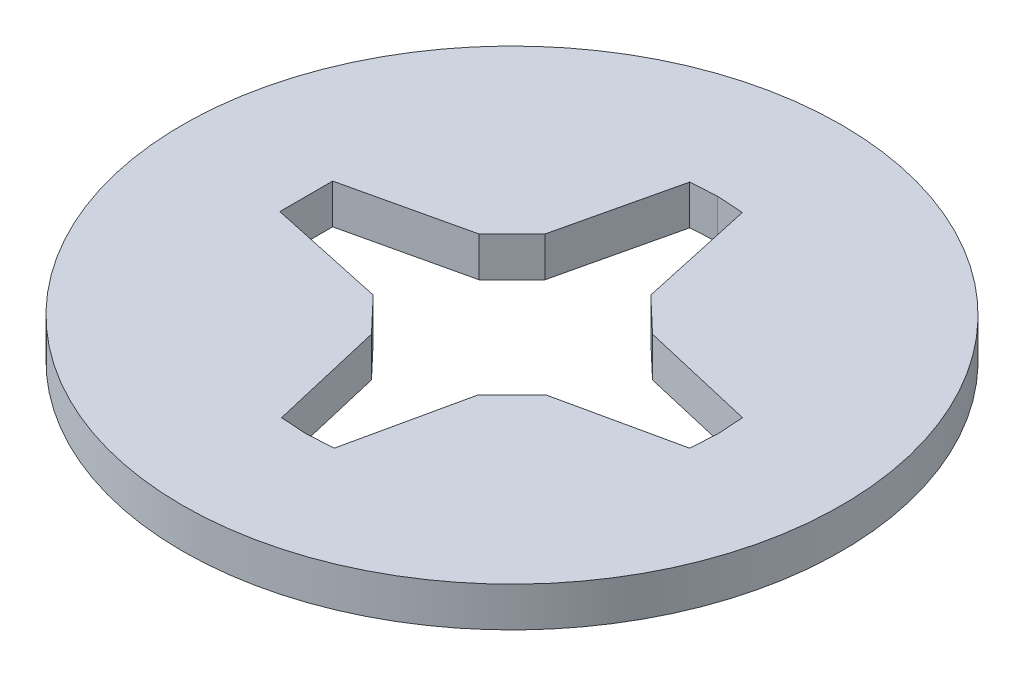
ISO-10303-21;
HEADER;
FILE_DESCRIPTION(('STEP AP214'),'2;1');
FILE_NAME('part.step','',(''),(''),'','','');
FILE_SCHEMA(('AUTOMOTIVE_DESIGN { 1 0 10303 214 1 1 1 1 }'));
ENDSEC;
DATA;
#1=APPLICATION_CONTEXT('core data for automotive mechanical design processes');
#2=APPLICATION_PROTOCOL_DEFINITION('international standard','automotive_design',2000,#1);
#3=PRODUCT_CONTEXT('',#1,'mechanical');
#4=PRODUCT('Part','Part','',(#3));
#5=PRODUCT_RELATED_PRODUCT_CATEGORY('part','',(#4));
#6=PRODUCT_DEFINITION_FORMATION('','',#4);
#7=PRODUCT_DEFINITION_CONTEXT('part definition',#1,'design');
#8=PRODUCT_DEFINITION('design','',#6,#7);
#9=PRODUCT_DEFINITION_SHAPE('','',#8);
#10=(LENGTH_UNIT() NAMED_UNIT(*) SI_UNIT(.MILLI.,.METRE.));
#11=(NAMED_UNIT(*) PLANE_ANGLE_UNIT() SI_UNIT($,.RADIAN.));
#12=(NAMED_UNIT(*) SI_UNIT($,.STERADIAN.) SOLID_ANGLE_UNIT());
#13=UNCERTAINTY_MEASURE_WITH_UNIT(LENGTH_MEASURE(1.E-05),#10,'distance_accuracy_value','');
#14=(GEOMETRIC_REPRESENTATION_CONTEXT(3) GLOBAL_UNCERTAINTY_ASSIGNED_CONTEXT((#13)) GLOBAL_UNIT_ASSIGNED_CONTEXT((#10,
#11,#12)) REPRESENTATION_CONTEXT('',''));
#15=CARTESIAN_POINT('',(0.,0.,0.));
#16=DIRECTION('',(0.,0.,1.));
#17=DIRECTION('',(1.,0.,0.));
#18=AXIS2_PLACEMENT_3D('',#15,#16,#17);
#19=CARTESIAN_POINT('',(0.0664001122128999,3.,0.0664001122129068));
#20=DIRECTION('',(0.,1.,0.));
#21=DIRECTION('',(0.,0.,1.));
#22=AXIS2_PLACEMENT_3D('',#19,#20,#21);
#23=PLANE('',#22);
#24=CARTESIAN_POINT('',(0.0664001122128999,3.,0.0664001122129068));
#25=DIRECTION('',(0.,1.,0.));
#26=DIRECTION('',(0.,0.,1.));
#27=AXIS2_PLACEMENT_3D('',#24,#25,#26);
#28=CIRCLE('',#27,24.9335998877871);
#29=CARTESIAN_POINT('',(0.0664001122128999,3.,25.));
#30=VERTEX_POINT('',#29);
#31=EDGE_CURVE('E11',#30,#30,#28,.T.);
#32=ORIENTED_EDGE('',*,*,#31,.T.);
#33=EDGE_LOOP('',(#32));
#34=FACE_BOUND('',#33,.T.);
#35=DIRECTION('',(0.688581474690036,0.,0.725158984439754));
#36=VECTOR('',#35,1.);
#37=CARTESIAN_POINT('',(-4.,3.,6.63280022442582));
#38=LINE('',#37,#36);
#39=CARTESIAN_POINT('',(-6.5,3.,4.));
#40=VERTEX_POINT('',#39);
#41=CARTESIAN_POINT('',(-4.,3.,6.63280022442582));
#42=VERTEX_POINT('',#41);
#43=EDGE_CURVE('E188',#40,#42,#38,.T.);
#44=ORIENTED_EDGE('',*,*,#43,.F.);
#45=DIRECTION('',(0.977690359369516,0.,0.210051329907491));
#46=VECTOR('',#45,1.);
#47=CARTESIAN_POINT('',(-15.5,3.,2.06640011221291));
#48=LINE('',#47,#46);
#49=CARTESIAN_POINT('',(-15.5,3.,2.06640011221291));
#50=VERTEX_POINT('',#49);
#51=EDGE_CURVE('E174',#50,#40,#48,.T.);
#52=ORIENTED_EDGE('',*,*,#51,.F.);
#53=DIRECTION('',(0.,0.,1.));
#54=VECTOR('',#53,1.);
#55=CARTESIAN_POINT('',(-15.5,3.,0.0664001122129068));
#56=LINE('',#55,#54);
#57=CARTESIAN_POINT('',(-15.5,3.,-1.93359988778709));
#58=VERTEX_POINT('',#57);
#59=EDGE_CURVE('E168',#58,#50,#56,.T.);
#60=ORIENTED_EDGE('',*,*,#59,.F.);
#61=DIRECTION('',(-0.974640275469277,0.,0.223777419399659));
#62=VECTOR('',#61,1.);
#63=CARTESIAN_POINT('',(-15.5,3.,-1.93359988778709));
#64=LINE('',#63,#62);
#65=CARTESIAN_POINT('',(-6.5,3.,-4.));
#66=VERTEX_POINT('',#65);
#67=EDGE_CURVE('E239',#66,#58,#64,.T.);
#68=ORIENTED_EDGE('',*,*,#67,.F.);
#69=DIRECTION('',(-0.707106781186548,0.,0.707106781186547));
#70=VECTOR('',#69,1.);
#71=CARTESIAN_POINT('',(-6.5,3.,-4.));
#72=LINE('',#71,#70);
#73=CARTESIAN_POINT('',(-4.,3.,-6.5));
#74=VERTEX_POINT('',#73);
#75=EDGE_CURVE('E236',#74,#66,#72,.T.);
#76=ORIENTED_EDGE('',*,*,#75,.F.);
#77=DIRECTION('',(-0.227282746645249,0.,0.973828810971103));
#78=VECTOR('',#77,1.);
#79=CARTESIAN_POINT('',(-1.92946872423652,3.,-15.3715181425646));
#80=LINE('',#79,#78);
#81=CARTESIAN_POINT('',(-1.92946872423652,3.,-15.3715181425646));
#82=VERTEX_POINT('',#81);
#83=EDGE_CURVE('E233',#82,#74,#80,.T.);
#84=ORIENTED_EDGE('',*,*,#83,.F.);
#85=DIRECTION('',(-0.997934418224708,0.,0.0642409287177079));
#86=VECTOR('',#85,1.);
#87=CARTESIAN_POINT('',(0.0664001122128999,3.,-15.5));
#88=LINE('',#87,#86);
#89=CARTESIAN_POINT('',(0.0664001122128999,3.,-15.5));
#90=VERTEX_POINT('',#89);
#91=EDGE_CURVE('E230',#90,#82,#88,.T.);
#92=ORIENTED_EDGE('',*,*,#91,.F.);
#93=DIRECTION('',(-0.99794234969612,0.,-0.064117600415077));
#94=VECTOR('',#93,1.);
#95=CARTESIAN_POINT('',(0.0664001122128999,3.,-15.5));
#96=LINE('',#95,#94);
#97=CARTESIAN_POINT('',(2.05845315665964,3.,-15.3720109822493));
#98=VERTEX_POINT('',#97);
#99=EDGE_CURVE('E227',#98,#90,#96,.T.);
#100=ORIENTED_EDGE('',*,*,#99,.F.);
#101=DIRECTION('',(-0.213780357901352,0.,-0.976881752606512));
#102=VECTOR('',#101,1.);
#103=CARTESIAN_POINT('',(2.05845315665964,3.,-15.3720109822493));
#104=LINE('',#103,#102);
#105=CARTESIAN_POINT('',(4.,3.,-6.5));
#106=VERTEX_POINT('',#105);
#107=EDGE_CURVE('E224',#106,#98,#104,.T.);
#108=ORIENTED_EDGE('',*,*,#107,.F.);
#109=DIRECTION('',(-0.725158984439753,0.,-0.688581474690037));
#110=VECTOR('',#109,1.);
#111=CARTESIAN_POINT('',(4.,3.,-6.5));
#112=LINE('',#111,#110);
#113=CARTESIAN_POINT('',(6.63280022442581,3.,-4.));
#114=VERTEX_POINT('',#113);
#115=EDGE_CURVE('E221',#114,#106,#112,.T.);
#116=ORIENTED_EDGE('',*,*,#115,.F.);
#117=DIRECTION('',(-0.973926076011745,0.,-0.226865595594318));
#118=VECTOR('',#117,1.);
#119=CARTESIAN_POINT('',(6.63280022442581,3.,-4.));
#120=LINE('',#119,#118);
#121=CARTESIAN_POINT('',(15.5037837135069,3.,-1.93359988778709));
#122=VERTEX_POINT('',#121);
#123=EDGE_CURVE('E218',#122,#114,#120,.T.);
#124=ORIENTED_EDGE('',*,*,#123,.F.);
#125=DIRECTION('',(-0.0643744533232966,0.,-0.997925813755375));
#126=VECTOR('',#125,1.);
#127=CARTESIAN_POINT('',(15.6328002244258,3.,0.0664001122129068));
#128=LINE('',#127,#126);
#129=CARTESIAN_POINT('',(15.6328002244258,3.,0.0664001122129068));
#130=VERTEX_POINT('',#129);
#131=EDGE_CURVE('E215',#130,#122,#128,.T.);
#132=ORIENTED_EDGE('',*,*,#131,.F.);
#133=DIRECTION('',(0.0643744533232966,0.,-0.997925813755375));
#134=VECTOR('',#133,1.);
#135=CARTESIAN_POINT('',(15.6328002244258,3.,0.0664001122129068));
#136=LINE('',#135,#134);
#137=CARTESIAN_POINT('',(15.5037837135069,3.,2.06640011221291));
#138=VERTEX_POINT('',#137);
#139=EDGE_CURVE('E212',#138,#130,#136,.T.);
#140=ORIENTED_EDGE('',*,*,#139,.F.);
#141=DIRECTION('',(0.977059036387169,0.,-0.21296863481315));
#142=VECTOR('',#141,1.);
#143=CARTESIAN_POINT('',(6.63280022442581,3.,4.));
#144=LINE('',#143,#142);
#145=CARTESIAN_POINT('',(6.63280022442581,3.,4.));
#146=VERTEX_POINT('',#145);
#147=EDGE_CURVE('E209',#146,#138,#144,.T.);
#148=ORIENTED_EDGE('',*,*,#147,.F.);
#149=DIRECTION('',(0.707106781186547,0.,-0.707106781186548));
#150=VECTOR('',#149,1.);
#151=CARTESIAN_POINT('',(6.63280022442581,3.,4.));
#152=LINE('',#151,#150);
#153=CARTESIAN_POINT('',(4.,3.,6.63280022442581));
#154=VERTEX_POINT('',#153);
#155=EDGE_CURVE('E206',#154,#146,#152,.T.);
#156=ORIENTED_EDGE('',*,*,#155,.F.);
#157=DIRECTION('',(0.213390669499355,0.,-0.976966950398332));
#158=VECTOR('',#157,1.);
#159=CARTESIAN_POINT('',(4.,3.,6.63280022442581));
#160=LINE('',#159,#158);
#161=CARTESIAN_POINT('',(2.06226894866232,3.,15.5043183669904));
#162=VERTEX_POINT('',#161);
#163=EDGE_CURVE('E203',#162,#154,#160,.T.);
#164=ORIENTED_EDGE('',*,*,#163,.F.);
#165=DIRECTION('',(0.997934418224708,0.,-0.0642409287177079));
#166=VECTOR('',#165,1.);
#167=CARTESIAN_POINT('',(0.0664001122128999,3.,15.6328002244258));
#168=LINE('',#167,#166);
#169=CARTESIAN_POINT('',(0.0664001122128999,3.,15.6328002244258));
#170=VERTEX_POINT('',#169);
#171=EDGE_CURVE('E200',#170,#162,#168,.T.);
#172=ORIENTED_EDGE('',*,*,#171,.F.);
#173=DIRECTION('',(0.997934418224708,0.,0.0642409287177087));
#174=VECTOR('',#173,1.);
#175=CARTESIAN_POINT('',(0.0664001122128999,3.,15.6328002244258));
#176=LINE('',#175,#174);
#177=CARTESIAN_POINT('',(-1.92946872423652,3.,15.5043183669904));
#178=VERTEX_POINT('',#177);
#179=EDGE_CURVE('E197',#178,#170,#176,.T.);
#180=ORIENTED_EDGE('',*,*,#179,.F.);
#181=DIRECTION('',(0.227282746645249,0.,0.973828810971103));
#182=VECTOR('',#181,1.);
#183=CARTESIAN_POINT('',(-4.,3.,6.63280022442582));
#184=LINE('',#183,#182);
#185=EDGE_CURVE('E192',#42,#178,#184,.T.);
#186=ORIENTED_EDGE('',*,*,#185,.F.);
#187=EDGE_LOOP('',(#44,#52,#60,#68,#76,#84,#92,#100,#108,#116,#124,#132,#140,#148,#156,#164,
#172,#180,#186));
#188=FACE_BOUND('',#187,.T.);
#189=ADVANCED_FACE('F39',(#34,#188),#23,.T.);
#190=CARTESIAN_POINT('',(0.0664001122128999,0.,0.0664001122129068));
#191=DIRECTION('',(0.,1.,0.));
#192=DIRECTION('',(0.,0.,1.));
#193=AXIS2_PLACEMENT_3D('',#190,#191,#192);
#194=PLANE('',#193);
#195=CARTESIAN_POINT('',(0.0664001122128999,0.,0.0664001122129068));
#196=DIRECTION('',(0.,1.,0.));
#197=DIRECTION('',(0.,0.,1.));
#198=AXIS2_PLACEMENT_3D('',#195,#196,#197);
#199=CIRCLE('',#198,24.9335998877871);
#200=CARTESIAN_POINT('',(0.0664001122128999,0.,25.));
#201=VERTEX_POINT('',#200);
#202=EDGE_CURVE('E43',#201,#201,#199,.T.);
#203=ORIENTED_EDGE('',*,*,#202,.F.);
#204=EDGE_LOOP('',(#203));
#205=FACE_BOUND('',#204,.T.);
#206=DIRECTION('',(0.977690359369516,0.,0.210051329907491));
#207=VECTOR('',#206,1.);
#208=CARTESIAN_POINT('',(-15.5,0.,2.06640011221291));
#209=LINE('',#208,#207);
#210=CARTESIAN_POINT('',(-15.5,0.,2.06640011221291));
#211=VERTEX_POINT('',#210);
#212=CARTESIAN_POINT('',(-6.5,0.,4.));
#213=VERTEX_POINT('',#212);
#214=EDGE_CURVE('E181',#211,#213,#209,.T.);
#215=ORIENTED_EDGE('',*,*,#214,.T.);
#216=DIRECTION('',(0.688581474690036,0.,0.725158984439754));
#217=VECTOR('',#216,1.);
#218=CARTESIAN_POINT('',(-4.,0.,6.63280022442582));
#219=LINE('',#218,#217);
#220=CARTESIAN_POINT('',(-4.,0.,6.63280022442582));
#221=VERTEX_POINT('',#220);
#222=EDGE_CURVE('E244',#213,#221,#219,.T.);
#223=ORIENTED_EDGE('',*,*,#222,.T.);
#224=DIRECTION('',(0.227282746645249,0.,0.973828810971103));
#225=VECTOR('',#224,1.);
#226=CARTESIAN_POINT('',(-4.,0.,6.63280022442582));
#227=LINE('',#226,#225);
#228=CARTESIAN_POINT('',(-1.92946872423652,0.,15.5043183669904));
#229=VERTEX_POINT('',#228);
#230=EDGE_CURVE('E248',#221,#229,#227,.T.);
#231=ORIENTED_EDGE('',*,*,#230,.T.);
#232=DIRECTION('',(0.997934418224708,0.,0.0642409287177087));
#233=VECTOR('',#232,1.);
#234=CARTESIAN_POINT('',(0.0664001122128999,0.,15.6328002244258));
#235=LINE('',#234,#233);
#236=CARTESIAN_POINT('',(0.0664001122128999,0.,15.6328002244258));
#237=VERTEX_POINT('',#236);
#238=EDGE_CURVE('E252',#229,#237,#235,.T.);
#239=ORIENTED_EDGE('',*,*,#238,.T.);
#240=DIRECTION('',(0.997934418224708,0.,-0.0642409287177079));
#241=VECTOR('',#240,1.);
#242=CARTESIAN_POINT('',(0.0664001122128999,0.,15.6328002244258));
#243=LINE('',#242,#241);
#244=CARTESIAN_POINT('',(2.06226894866232,0.,15.5043183669904));
#245=VERTEX_POINT('',#244);
#246=EDGE_CURVE('E256',#237,#245,#243,.T.);
#247=ORIENTED_EDGE('',*,*,#246,.T.);
#248=DIRECTION('',(0.213390669499355,0.,-0.976966950398332));
#249=VECTOR('',#248,1.);
#250=CARTESIAN_POINT('',(4.,0.,6.63280022442581));
#251=LINE('',#250,#249);
#252=CARTESIAN_POINT('',(4.,0.,6.63280022442581));
#253=VERTEX_POINT('',#252);
#254=EDGE_CURVE('E260',#245,#253,#251,.T.);
#255=ORIENTED_EDGE('',*,*,#254,.T.);
#256=DIRECTION('',(0.707106781186547,0.,-0.707106781186548));
#257=VECTOR('',#256,1.);
#258=CARTESIAN_POINT('',(6.63280022442581,0.,4.));
#259=LINE('',#258,#257);
#260=CARTESIAN_POINT('',(6.63280022442581,0.,4.));
#261=VERTEX_POINT('',#260);
#262=EDGE_CURVE('E264',#253,#261,#259,.T.);
#263=ORIENTED_EDGE('',*,*,#262,.T.);
#264=DIRECTION('',(0.977059036387169,0.,-0.21296863481315));
#265=VECTOR('',#264,1.);
#266=CARTESIAN_POINT('',(6.63280022442581,0.,4.));
#267=LINE('',#266,#265);
#268=CARTESIAN_POINT('',(15.5037837135069,0.,2.06640011221291));
#269=VERTEX_POINT('',#268);
#270=EDGE_CURVE('E268',#261,#269,#267,.T.);
#271=ORIENTED_EDGE('',*,*,#270,.T.);
#272=DIRECTION('',(0.0643744533232966,0.,-0.997925813755375));
#273=VECTOR('',#272,1.);
#274=CARTESIAN_POINT('',(15.6328002244258,0.,0.0664001122129068));
#275=LINE('',#274,#273);
#276=CARTESIAN_POINT('',(15.6328002244258,0.,0.0664001122129068));
#277=VERTEX_POINT('',#276);
#278=EDGE_CURVE('E272',#269,#277,#275,.T.);
#279=ORIENTED_EDGE('',*,*,#278,.T.);
#280=DIRECTION('',(-0.0643744533232966,0.,-0.997925813755375));
#281=VECTOR('',#280,1.);
#282=CARTESIAN_POINT('',(15.6328002244258,0.,0.0664001122129068));
#283=LINE('',#282,#281);
#284=CARTESIAN_POINT('',(15.5037837135069,0.,-1.93359988778709));
#285=VERTEX_POINT('',#284);
#286=EDGE_CURVE('E276',#277,#285,#283,.T.);
#287=ORIENTED_EDGE('',*,*,#286,.T.);
#288=DIRECTION('',(-0.973926076011745,0.,-0.226865595594318));
#289=VECTOR('',#288,1.);
#290=CARTESIAN_POINT('',(6.63280022442581,0.,-4.));
#291=LINE('',#290,#289);
#292=CARTESIAN_POINT('',(6.63280022442581,0.,-4.));
#293=VERTEX_POINT('',#292);
#294=EDGE_CURVE('E280',#285,#293,#291,.T.);
#295=ORIENTED_EDGE('',*,*,#294,.T.);
#296=DIRECTION('',(-0.725158984439753,0.,-0.688581474690037));
#297=VECTOR('',#296,1.);
#298=CARTESIAN_POINT('',(4.,0.,-6.5));
#299=LINE('',#298,#297);
#300=CARTESIAN_POINT('',(4.,0.,-6.5));
#301=VERTEX_POINT('',#300);
#302=EDGE_CURVE('E284',#293,#301,#299,.T.);
#303=ORIENTED_EDGE('',*,*,#302,.T.);
#304=DIRECTION('',(-0.213780357901352,0.,-0.976881752606512));
#305=VECTOR('',#304,1.);
#306=CARTESIAN_POINT('',(2.05845315665964,0.,-15.3720109822493));
#307=LINE('',#306,#305);
#308=CARTESIAN_POINT('',(2.05845315665964,0.,-15.3720109822493));
#309=VERTEX_POINT('',#308);
#310=EDGE_CURVE('E288',#301,#309,#307,.T.);
#311=ORIENTED_EDGE('',*,*,#310,.T.);
#312=DIRECTION('',(-0.99794234969612,0.,-0.064117600415077));
#313=VECTOR('',#312,1.);
#314=CARTESIAN_POINT('',(0.0664001122128999,0.,-15.5));
#315=LINE('',#314,#313);
#316=CARTESIAN_POINT('',(0.0664001122128999,0.,-15.5));
#317=VERTEX_POINT('',#316);
#318=EDGE_CURVE('E292',#309,#317,#315,.T.);
#319=ORIENTED_EDGE('',*,*,#318,.T.);
#320=DIRECTION('',(-0.997934418224708,0.,0.0642409287177079));
#321=VECTOR('',#320,1.);
#322=CARTESIAN_POINT('',(0.0664001122128999,0.,-15.5));
#323=LINE('',#322,#321);
#324=CARTESIAN_POINT('',(-1.92946872423652,0.,-15.3715181425646));
#325=VERTEX_POINT('',#324);
#326=EDGE_CURVE('E296',#317,#325,#323,.T.);
#327=ORIENTED_EDGE('',*,*,#326,.T.);
#328=DIRECTION('',(-0.227282746645249,0.,0.973828810971103));
#329=VECTOR('',#328,1.);
#330=CARTESIAN_POINT('',(-1.92946872423652,0.,-15.3715181425646));
#331=LINE('',#330,#329);
#332=CARTESIAN_POINT('',(-4.,0.,-6.5));
#333=VERTEX_POINT('',#332);
#334=EDGE_CURVE('E300',#325,#333,#331,.T.);
#335=ORIENTED_EDGE('',*,*,#334,.T.);
#336=DIRECTION('',(-0.707106781186548,0.,0.707106781186547));
#337=VECTOR('',#336,1.);
#338=CARTESIAN_POINT('',(-6.5,0.,-4.));
#339=LINE('',#338,#337);
#340=CARTESIAN_POINT('',(-6.5,0.,-4.));
#341=VERTEX_POINT('',#340);
#342=EDGE_CURVE('E304',#333,#341,#339,.T.);
#343=ORIENTED_EDGE('',*,*,#342,.T.);
#344=DIRECTION('',(-0.974640275469277,0.,0.223777419399659));
#345=VECTOR('',#344,1.);
#346=CARTESIAN_POINT('',(-15.5,0.,-1.93359988778709));
#347=LINE('',#346,#345);
#348=CARTESIAN_POINT('',(-15.5,0.,-1.93359988778709));
#349=VERTEX_POINT('',#348);
#350=EDGE_CURVE('E308',#341,#349,#347,.T.);
#351=ORIENTED_EDGE('',*,*,#350,.T.);
#352=DIRECTION('',(0.,0.,1.));
#353=VECTOR('',#352,1.);
#354=CARTESIAN_POINT('',(-15.5,0.,0.0664001122129068));
#355=LINE('',#354,#353);
#356=EDGE_CURVE('E175',#349,#211,#355,.T.);
#357=ORIENTED_EDGE('',*,*,#356,.T.);
#358=EDGE_LOOP('',(#215,#223,#231,#239,#247,#255,#263,#271,#279,#287,#295,#303,#311,#319,#327,
#335,#343,#351,#357));
#359=FACE_BOUND('',#358,.T.);
#360=ADVANCED_FACE('F371',(#205,#359),#194,.F.);
#361=CARTESIAN_POINT('',(0.0664001122128999,3.,0.0664001122129068));
#362=DIRECTION('',(0.,-1.,0.));
#363=DIRECTION('',(0.,0.,-1.));
#364=AXIS2_PLACEMENT_3D('',#361,#362,#363);
#365=CYLINDRICAL_SURFACE('',#364,24.9335998877871);
#366=ORIENTED_EDGE('',*,*,#31,.F.);
#367=EDGE_LOOP('',(#366));
#368=FACE_BOUND('',#367,.T.);
#369=ORIENTED_EDGE('',*,*,#202,.T.);
#370=EDGE_LOOP('',(#369));
#371=FACE_BOUND('',#370,.T.);
#372=ADVANCED_FACE('F41',(#368,#371),#365,.T.);
#373=CARTESIAN_POINT('',(-15.5,3.,2.06640011221291));
#374=DIRECTION('',(0.210051329907491,0.,-0.977690359369517));
#375=DIRECTION('',(-0.977690359369517,0.,-0.210051329907491));
#376=AXIS2_PLACEMENT_3D('',#373,#374,#375);
#377=PLANE('',#376);
#378=ORIENTED_EDGE('',*,*,#214,.F.);
#379=DIRECTION('',(0.,-1.,0.));
#380=VECTOR('',#379,1.);
#381=CARTESIAN_POINT('',(-15.5,3.,2.06640011221291));
#382=LINE('',#381,#380);
#383=EDGE_CURVE('E60',#50,#211,#382,.T.);
#384=ORIENTED_EDGE('',*,*,#383,.F.);
#385=ORIENTED_EDGE('',*,*,#51,.T.);
#386=DIRECTION('',(0.,-1.,0.));
#387=VECTOR('',#386,1.);
#388=CARTESIAN_POINT('',(-6.5,3.,4.));
#389=LINE('',#388,#387);
#390=EDGE_CURVE('E184',#40,#213,#389,.T.);
#391=ORIENTED_EDGE('',*,*,#390,.T.);
#392=EDGE_LOOP('',(#378,#384,#385,#391));
#393=FACE_BOUND('',#392,.T.);
#394=ADVANCED_FACE('F178',(#393),#377,.T.);
#395=CARTESIAN_POINT('',(-4.,3.,6.63280022442582));
#396=DIRECTION('',(0.725158984439754,0.,-0.688581474690036));
#397=DIRECTION('',(-0.688581474690036,0.,-0.725158984439754));
#398=AXIS2_PLACEMENT_3D('',#395,#396,#397);
#399=PLANE('',#398);
#400=ORIENTED_EDGE('',*,*,#222,.F.);
#401=ORIENTED_EDGE('',*,*,#390,.F.);
#402=ORIENTED_EDGE('',*,*,#43,.T.);
#403=DIRECTION('',(0.,-1.,0.));
#404=VECTOR('',#403,1.);
#405=CARTESIAN_POINT('',(-4.,3.,6.63280022442582));
#406=LINE('',#405,#404);
#407=EDGE_CURVE('E361',#42,#221,#406,.T.);
#408=ORIENTED_EDGE('',*,*,#407,.T.);
#409=EDGE_LOOP('',(#400,#401,#402,#408));
#410=FACE_BOUND('',#409,.T.);
#411=ADVANCED_FACE('F367',(#410),#399,.T.);
#412=CARTESIAN_POINT('',(-4.,3.,6.63280022442582));
#413=DIRECTION('',(0.973828810971103,0.,-0.227282746645249));
#414=DIRECTION('',(-0.227282746645249,0.,-0.973828810971103));
#415=AXIS2_PLACEMENT_3D('',#412,#413,#414);
#416=PLANE('',#415);
#417=ORIENTED_EDGE('',*,*,#230,.F.);
#418=ORIENTED_EDGE('',*,*,#407,.F.);
#419=ORIENTED_EDGE('',*,*,#185,.T.);
#420=DIRECTION('',(0.,-1.,0.));
#421=VECTOR('',#420,1.);
#422=CARTESIAN_POINT('',(-1.92946872423652,3.,15.5043183669904));
#423=LINE('',#422,#421);
#424=EDGE_CURVE('E358',#178,#229,#423,.T.);
#425=ORIENTED_EDGE('',*,*,#424,.T.);
#426=EDGE_LOOP('',(#417,#418,#419,#425));
#427=FACE_BOUND('',#426,.T.);
#428=ADVANCED_FACE('F447',(#427),#416,.T.);
#429=CARTESIAN_POINT('',(0.0664001122128999,3.,15.6328002244258));
#430=DIRECTION('',(0.0642409287177088,0.,-0.997934418224708));
#431=DIRECTION('',(-0.997934418224708,0.,-0.0642409287177088));
#432=AXIS2_PLACEMENT_3D('',#429,#430,#431);
#433=PLANE('',#432);
#434=ORIENTED_EDGE('',*,*,#238,.F.);
#435=ORIENTED_EDGE('',*,*,#424,.F.);
#436=ORIENTED_EDGE('',*,*,#179,.T.);
#437=DIRECTION('',(0.,-1.,0.));
#438=VECTOR('',#437,1.);
#439=CARTESIAN_POINT('',(0.0664001122128999,3.,15.6328002244258));
#440=LINE('',#439,#438);
#441=EDGE_CURVE('E355',#170,#237,#440,.T.);
#442=ORIENTED_EDGE('',*,*,#441,.T.);
#443=EDGE_LOOP('',(#434,#435,#436,#442));
#444=FACE_BOUND('',#443,.T.);
#445=ADVANCED_FACE('F444',(#444),#433,.T.);
#446=CARTESIAN_POINT('',(0.0664001122128999,3.,15.6328002244258));
#447=DIRECTION('',(-0.0642409287177079,0.,-0.997934418224708));
#448=DIRECTION('',(-0.997934418224708,0.,0.0642409287177079));
#449=AXIS2_PLACEMENT_3D('',#446,#447,#448);
#450=PLANE('',#449);
#451=ORIENTED_EDGE('',*,*,#246,.F.);
#452=ORIENTED_EDGE('',*,*,#441,.F.);
#453=ORIENTED_EDGE('',*,*,#171,.T.);
#454=DIRECTION('',(0.,-1.,0.));
#455=VECTOR('',#454,1.);
#456=CARTESIAN_POINT('',(2.06226894866232,3.,15.5043183669904));
#457=LINE('',#456,#455);
#458=EDGE_CURVE('E352',#162,#245,#457,.T.);
#459=ORIENTED_EDGE('',*,*,#458,.T.);
#460=EDGE_LOOP('',(#451,#452,#453,#459));
#461=FACE_BOUND('',#460,.T.);
#462=ADVANCED_FACE('F441',(#461),#450,.T.);
#463=CARTESIAN_POINT('',(4.,3.,6.63280022442581));
#464=DIRECTION('',(-0.976966950398332,0.,-0.213390669499355));
#465=DIRECTION('',(-0.213390669499355,0.,0.976966950398332));
#466=AXIS2_PLACEMENT_3D('',#463,#464,#465);
#467=PLANE('',#466);
#468=ORIENTED_EDGE('',*,*,#254,.F.);
#469=ORIENTED_EDGE('',*,*,#458,.F.);
#470=ORIENTED_EDGE('',*,*,#163,.T.);
#471=DIRECTION('',(0.,-1.,0.));
#472=VECTOR('',#471,1.);
#473=CARTESIAN_POINT('',(4.,3.,6.63280022442581));
#474=LINE('',#473,#472);
#475=EDGE_CURVE('E349',#154,#253,#474,.T.);
#476=ORIENTED_EDGE('',*,*,#475,.T.);
#477=EDGE_LOOP('',(#468,#469,#470,#476));
#478=FACE_BOUND('',#477,.T.);
#479=ADVANCED_FACE('F434',(#478),#467,.T.);
#480=CARTESIAN_POINT('',(6.63280022442581,3.,4.));
#481=DIRECTION('',(-0.707106781186548,0.,-0.707106781186547));
#482=DIRECTION('',(-0.707106781186547,0.,0.707106781186548));
#483=AXIS2_PLACEMENT_3D('',#480,#481,#482);
#484=PLANE('',#483);
#485=ORIENTED_EDGE('',*,*,#262,.F.);
#486=ORIENTED_EDGE('',*,*,#475,.F.);
#487=ORIENTED_EDGE('',*,*,#155,.T.);
#488=DIRECTION('',(0.,-1.,0.));
#489=VECTOR('',#488,1.);
#490=CARTESIAN_POINT('',(6.63280022442581,3.,4.));
#491=LINE('',#490,#489);
#492=EDGE_CURVE('E346',#146,#261,#491,.T.);
#493=ORIENTED_EDGE('',*,*,#492,.T.);
#494=EDGE_LOOP('',(#485,#486,#487,#493));
#495=FACE_BOUND('',#494,.T.);
#496=ADVANCED_FACE('F430',(#495),#484,.T.);
#497=CARTESIAN_POINT('',(6.63280022442581,3.,4.));
#498=DIRECTION('',(-0.212968634813149,0.,-0.977059036387169));
#499=DIRECTION('',(-0.977059036387169,0.,0.21296863481315));
#500=AXIS2_PLACEMENT_3D('',#497,#498,#499);
#501=PLANE('',#500);
#502=ORIENTED_EDGE('',*,*,#270,.F.);
#503=ORIENTED_EDGE('',*,*,#492,.F.);
#504=ORIENTED_EDGE('',*,*,#147,.T.);
#505=DIRECTION('',(0.,-1.,0.));
#506=VECTOR('',#505,1.);
#507=CARTESIAN_POINT('',(15.5037837135069,3.,2.06640011221291));
#508=LINE('',#507,#506);
#509=EDGE_CURVE('E343',#138,#269,#508,.T.);
#510=ORIENTED_EDGE('',*,*,#509,.T.);
#511=EDGE_LOOP('',(#502,#503,#504,#510));
#512=FACE_BOUND('',#511,.T.);
#513=ADVANCED_FACE('F427',(#512),#501,.T.);
#514=CARTESIAN_POINT('',(15.6328002244258,3.,0.0664001122129068));
#515=DIRECTION('',(-0.997925813755375,0.,-0.0643744533232966));
#516=DIRECTION('',(-0.0643744533232966,0.,0.997925813755375));
#517=AXIS2_PLACEMENT_3D('',#514,#515,#516);
#518=PLANE('',#517);
#519=ORIENTED_EDGE('',*,*,#278,.F.);
#520=ORIENTED_EDGE('',*,*,#509,.F.);
#521=ORIENTED_EDGE('',*,*,#139,.T.);
#522=DIRECTION('',(0.,-1.,0.));
#523=VECTOR('',#522,1.);
#524=CARTESIAN_POINT('',(15.6328002244258,3.,0.0664001122129068));
#525=LINE('',#524,#523);
#526=EDGE_CURVE('E340',#130,#277,#525,.T.);
#527=ORIENTED_EDGE('',*,*,#526,.T.);
#528=EDGE_LOOP('',(#519,#520,#521,#527));
#529=FACE_BOUND('',#528,.T.);
#530=ADVANCED_FACE('F419',(#529),#518,.T.);
#531=CARTESIAN_POINT('',(15.6328002244258,3.,0.0664001122129068));
#532=DIRECTION('',(-0.997925813755375,0.,0.0643744533232966));
#533=DIRECTION('',(0.0643744533232966,0.,0.997925813755375));
#534=AXIS2_PLACEMENT_3D('',#531,#532,#533);
#535=PLANE('',#534);
#536=ORIENTED_EDGE('',*,*,#286,.F.);
#537=ORIENTED_EDGE('',*,*,#526,.F.);
#538=ORIENTED_EDGE('',*,*,#131,.T.);
#539=DIRECTION('',(0.,-1.,0.));
#540=VECTOR('',#539,1.);
#541=CARTESIAN_POINT('',(15.5037837135069,3.,-1.93359988778709));
#542=LINE('',#541,#540);
#543=EDGE_CURVE('E337',#122,#285,#542,.T.);
#544=ORIENTED_EDGE('',*,*,#543,.T.);
#545=EDGE_LOOP('',(#536,#537,#538,#544));
#546=FACE_BOUND('',#545,.T.);
#547=ADVANCED_FACE('F415',(#546),#535,.T.);
#548=CARTESIAN_POINT('',(6.63280022442581,3.,-4.));
#549=DIRECTION('',(-0.226865595594318,0.,0.973926076011745));
#550=DIRECTION('',(0.973926076011745,0.,0.226865595594318));
#551=AXIS2_PLACEMENT_3D('',#548,#549,#550);
#552=PLANE('',#551);
#553=ORIENTED_EDGE('',*,*,#294,.F.);
#554=ORIENTED_EDGE('',*,*,#543,.F.);
#555=ORIENTED_EDGE('',*,*,#123,.T.);
#556=DIRECTION('',(0.,-1.,0.));
#557=VECTOR('',#556,1.);
#558=CARTESIAN_POINT('',(6.63280022442581,3.,-4.));
#559=LINE('',#558,#557);
#560=EDGE_CURVE('E334',#114,#293,#559,.T.);
#561=ORIENTED_EDGE('',*,*,#560,.T.);
#562=EDGE_LOOP('',(#553,#554,#555,#561));
#563=FACE_BOUND('',#562,.T.);
#564=ADVANCED_FACE('F412',(#563),#552,.T.);
#565=CARTESIAN_POINT('',(4.,3.,-6.5));
#566=DIRECTION('',(-0.688581474690037,0.,0.725158984439753));
#567=DIRECTION('',(0.725158984439753,0.,0.688581474690037));
#568=AXIS2_PLACEMENT_3D('',#565,#566,#567);
#569=PLANE('',#568);
#570=ORIENTED_EDGE('',*,*,#302,.F.);
#571=ORIENTED_EDGE('',*,*,#560,.F.);
#572=ORIENTED_EDGE('',*,*,#115,.T.);
#573=DIRECTION('',(0.,-1.,0.));
#574=VECTOR('',#573,1.);
#575=CARTESIAN_POINT('',(4.,3.,-6.5));
#576=LINE('',#575,#574);
#577=EDGE_CURVE('E331',#106,#301,#576,.T.);
#578=ORIENTED_EDGE('',*,*,#577,.T.);
#579=EDGE_LOOP('',(#570,#571,#572,#578));
#580=FACE_BOUND('',#579,.T.);
#581=ADVANCED_FACE('F404',(#580),#569,.T.);
#582=CARTESIAN_POINT('',(2.05845315665964,3.,-15.3720109822493));
#583=DIRECTION('',(-0.976881752606512,0.,0.213780357901352));
#584=DIRECTION('',(0.213780357901352,0.,0.976881752606512));
#585=AXIS2_PLACEMENT_3D('',#582,#583,#584);
#586=PLANE('',#585);
#587=ORIENTED_EDGE('',*,*,#310,.F.);
#588=ORIENTED_EDGE('',*,*,#577,.F.);
#589=ORIENTED_EDGE('',*,*,#107,.T.);
#590=DIRECTION('',(0.,-1.,0.));
#591=VECTOR('',#590,1.);
#592=CARTESIAN_POINT('',(2.05845315665964,3.,-15.3720109822493));
#593=LINE('',#592,#591);
#594=EDGE_CURVE('E328',#98,#309,#593,.T.);
#595=ORIENTED_EDGE('',*,*,#594,.T.);
#596=EDGE_LOOP('',(#587,#588,#589,#595));
#597=FACE_BOUND('',#596,.T.);
#598=ADVANCED_FACE('F400',(#597),#586,.T.);
#599=CARTESIAN_POINT('',(0.0664001122128999,3.,-15.5));
#600=DIRECTION('',(-0.0641176004150771,0.,0.99794234969612));
#601=DIRECTION('',(0.99794234969612,0.,0.0641176004150771));
#602=AXIS2_PLACEMENT_3D('',#599,#600,#601);
#603=PLANE('',#602);
#604=ORIENTED_EDGE('',*,*,#318,.F.);
#605=ORIENTED_EDGE('',*,*,#594,.F.);
#606=ORIENTED_EDGE('',*,*,#99,.T.);
#607=DIRECTION('',(0.,-1.,0.));
#608=VECTOR('',#607,1.);
#609=CARTESIAN_POINT('',(0.0664001122128999,3.,-15.5));
#610=LINE('',#609,#608);
#611=EDGE_CURVE('E325',#90,#317,#610,.T.);
#612=ORIENTED_EDGE('',*,*,#611,.T.);
#613=EDGE_LOOP('',(#604,#605,#606,#612));
#614=FACE_BOUND('',#613,.T.);
#615=ADVANCED_FACE('F397',(#614),#603,.T.);
#616=CARTESIAN_POINT('',(0.0664001122128999,3.,-15.5));
#617=DIRECTION('',(0.0642409287177079,0.,0.997934418224708));
#618=DIRECTION('',(0.997934418224708,0.,-0.0642409287177079));
#619=AXIS2_PLACEMENT_3D('',#616,#617,#618);
#620=PLANE('',#619);
#621=ORIENTED_EDGE('',*,*,#326,.F.);
#622=ORIENTED_EDGE('',*,*,#611,.F.);
#623=ORIENTED_EDGE('',*,*,#91,.T.);
#624=DIRECTION('',(0.,-1.,0.));
#625=VECTOR('',#624,1.);
#626=CARTESIAN_POINT('',(-1.92946872423652,3.,-15.3715181425646));
#627=LINE('',#626,#625);
#628=EDGE_CURVE('E322',#82,#325,#627,.T.);
#629=ORIENTED_EDGE('',*,*,#628,.T.);
#630=EDGE_LOOP('',(#621,#622,#623,#629));
#631=FACE_BOUND('',#630,.T.);
#632=ADVANCED_FACE('F389',(#631),#620,.T.);
#633=CARTESIAN_POINT('',(-1.92946872423652,3.,-15.3715181425646));
#634=DIRECTION('',(0.973828810971103,0.,0.227282746645249));
#635=DIRECTION('',(0.227282746645249,0.,-0.973828810971103));
#636=AXIS2_PLACEMENT_3D('',#633,#634,#635);
#637=PLANE('',#636);
#638=ORIENTED_EDGE('',*,*,#334,.F.);
#639=ORIENTED_EDGE('',*,*,#628,.F.);
#640=ORIENTED_EDGE('',*,*,#83,.T.);
#641=DIRECTION('',(0.,-1.,0.));
#642=VECTOR('',#641,1.);
#643=CARTESIAN_POINT('',(-4.,3.,-6.5));
#644=LINE('',#643,#642);
#645=EDGE_CURVE('E319',#74,#333,#644,.T.);
#646=ORIENTED_EDGE('',*,*,#645,.T.);
#647=EDGE_LOOP('',(#638,#639,#640,#646));
#648=FACE_BOUND('',#647,.T.);
#649=ADVANCED_FACE('F385',(#648),#637,.T.);
#650=CARTESIAN_POINT('',(-6.5,3.,-4.));
#651=DIRECTION('',(0.707106781186547,0.,0.707106781186548));
#652=DIRECTION('',(0.707106781186548,0.,-0.707106781186547));
#653=AXIS2_PLACEMENT_3D('',#650,#651,#652);
#654=PLANE('',#653);
#655=ORIENTED_EDGE('',*,*,#342,.F.);
#656=ORIENTED_EDGE('',*,*,#645,.F.);
#657=ORIENTED_EDGE('',*,*,#75,.T.);
#658=DIRECTION('',(0.,-1.,0.));
#659=VECTOR('',#658,1.);
#660=CARTESIAN_POINT('',(-6.5,3.,-4.));
#661=LINE('',#660,#659);
#662=EDGE_CURVE('E316',#66,#341,#661,.T.);
#663=ORIENTED_EDGE('',*,*,#662,.T.);
#664=EDGE_LOOP('',(#655,#656,#657,#663));
#665=FACE_BOUND('',#664,.T.);
#666=ADVANCED_FACE('F382',(#665),#654,.T.);
#667=CARTESIAN_POINT('',(-15.5,3.,-1.93359988778709));
#668=DIRECTION('',(0.223777419399659,0.,0.974640275469277));
#669=DIRECTION('',(0.974640275469278,0.,-0.223777419399659));
#670=AXIS2_PLACEMENT_3D('',#667,#668,#669);
#671=PLANE('',#670);
#672=ORIENTED_EDGE('',*,*,#350,.F.);
#673=ORIENTED_EDGE('',*,*,#662,.F.);
#674=ORIENTED_EDGE('',*,*,#67,.T.);
#675=DIRECTION('',(0.,-1.,0.));
#676=VECTOR('',#675,1.);
#677=CARTESIAN_POINT('',(-15.5,3.,-1.93359988778709));
#678=LINE('',#677,#676);
#679=EDGE_CURVE('E55',#58,#349,#678,.T.);
#680=ORIENTED_EDGE('',*,*,#679,.T.);
#681=EDGE_LOOP('',(#672,#673,#674,#680));
#682=FACE_BOUND('',#681,.T.);
#683=ADVANCED_FACE('F376',(#682),#671,.T.);
#684=CARTESIAN_POINT('',(-15.5,3.,0.0664001122129068));
#685=DIRECTION('',(1.,0.,0.));
#686=DIRECTION('',(0.,0.,-1.));
#687=AXIS2_PLACEMENT_3D('',#684,#685,#686);
#688=PLANE('',#687);
#689=ORIENTED_EDGE('',*,*,#356,.F.);
#690=ORIENTED_EDGE('',*,*,#679,.F.);
#691=ORIENTED_EDGE('',*,*,#59,.T.);
#692=ORIENTED_EDGE('',*,*,#383,.T.);
#693=EDGE_LOOP('',(#689,#690,#691,#692));
#694=FACE_BOUND('',#693,.T.);
#695=ADVANCED_FACE('F169',(#694),#688,.T.);
#696=CLOSED_SHELL('',(#189,#360,#372,#394,#411,#428,#445,#462,#479,#496,#513,#530,#547,#564,
#581,#598,#615,#632,#649,#666,#683,#695));
#697=MANIFOLD_SOLID_BREP('B2',#696);
#698=ADVANCED_BREP_SHAPE_REPRESENTATION('',(#18,#697),#14);
#699=SHAPE_DEFINITION_REPRESENTATION(#9,#698);
ENDSEC;
END-ISO-10303-21;
